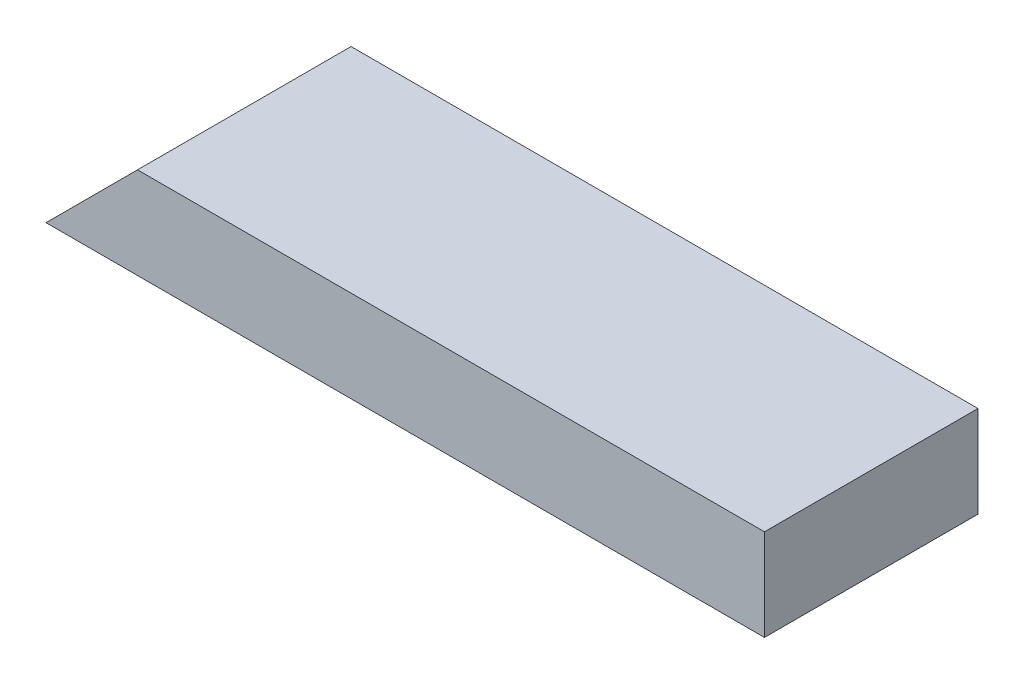
ISO-10303-21;
HEADER;
FILE_DESCRIPTION(('STEP AP214'),'2;1');
FILE_NAME('part.step','',(''),(''),'','','');
FILE_SCHEMA(('AUTOMOTIVE_DESIGN { 1 0 10303 214 1 1 1 1 }'));
ENDSEC;
DATA;
#1=APPLICATION_CONTEXT('core data for automotive mechanical design processes');
#2=APPLICATION_PROTOCOL_DEFINITION('international standard','automotive_design',2000,#1);
#3=PRODUCT_CONTEXT('',#1,'mechanical');
#4=PRODUCT('Part','Part','',(#3));
#5=PRODUCT_RELATED_PRODUCT_CATEGORY('part','',(#4));
#6=PRODUCT_DEFINITION_FORMATION('','',#4);
#7=PRODUCT_DEFINITION_CONTEXT('part definition',#1,'design');
#8=PRODUCT_DEFINITION('design','',#6,#7);
#9=PRODUCT_DEFINITION_SHAPE('','',#8);
#10=(LENGTH_UNIT() NAMED_UNIT(*) SI_UNIT(.MILLI.,.METRE.));
#11=(NAMED_UNIT(*) PLANE_ANGLE_UNIT() SI_UNIT($,.RADIAN.));
#12=(NAMED_UNIT(*) SI_UNIT($,.STERADIAN.) SOLID_ANGLE_UNIT());
#13=UNCERTAINTY_MEASURE_WITH_UNIT(LENGTH_MEASURE(1.E-05),#10,'distance_accuracy_value','');
#14=(GEOMETRIC_REPRESENTATION_CONTEXT(3) GLOBAL_UNCERTAINTY_ASSIGNED_CONTEXT((#13)) GLOBAL_UNIT_ASSIGNED_CONTEXT((#10,
#11,#12)) REPRESENTATION_CONTEXT('',''));
#15=CARTESIAN_POINT('',(0.,0.,0.));
#16=DIRECTION('',(0.,0.,1.));
#17=DIRECTION('',(1.,0.,0.));
#18=AXIS2_PLACEMENT_3D('',#15,#16,#17);
#19=CARTESIAN_POINT('',(0.,38.1,0.));
#20=DIRECTION('',(0.,0.,-1.));
#21=DIRECTION('',(-1.,0.,0.));
#22=AXIS2_PLACEMENT_3D('',#19,#20,#21);
#23=PLANE('',#22);
#24=DIRECTION('',(1.,0.,0.));
#25=VECTOR('',#24,1.);
#26=CARTESIAN_POINT('',(0.,38.1,0.));
#27=LINE('',#26,#25);
#28=CARTESIAN_POINT('',(38.1,38.1,0.));
#29=VERTEX_POINT('',#28);
#30=CARTESIAN_POINT('',(299.0977,38.1,0.));
#31=VERTEX_POINT('',#30);
#32=EDGE_CURVE('E92',#29,#31,#27,.T.);
#33=ORIENTED_EDGE('',*,*,#32,.F.);
#34=DIRECTION('',(0.707106781186547,0.707106781186547,0.));
#35=VECTOR('',#34,1.);
#36=CARTESIAN_POINT('',(0.,0.,0.));
#37=LINE('',#36,#35);
#38=CARTESIAN_POINT('',(0.,0.,0.));
#39=VERTEX_POINT('',#38);
#40=EDGE_CURVE('E86',#39,#29,#37,.T.);
#41=ORIENTED_EDGE('',*,*,#40,.F.);
#42=DIRECTION('',(1.,0.,0.));
#43=VECTOR('',#42,1.);
#44=CARTESIAN_POINT('',(0.,0.,0.));
#45=LINE('',#44,#43);
#46=CARTESIAN_POINT('',(299.0977,0.,0.));
#47=VERTEX_POINT('',#46);
#48=EDGE_CURVE('E96',#39,#47,#45,.T.);
#49=ORIENTED_EDGE('',*,*,#48,.T.);
#50=DIRECTION('',(0.,-1.,0.));
#51=VECTOR('',#50,1.);
#52=CARTESIAN_POINT('',(299.0977,38.1,0.));
#53=LINE('',#52,#51);
#54=EDGE_CURVE('E11',#31,#47,#53,.T.);
#55=ORIENTED_EDGE('',*,*,#54,.F.);
#56=EDGE_LOOP('',(#33,#41,#49,#55));
#57=FACE_BOUND('',#56,.T.);
#58=ADVANCED_FACE('F39',(#57),#23,.F.);
#59=CARTESIAN_POINT('',(299.0977,38.1,0.));
#60=DIRECTION('',(-1.,0.,0.));
#61=DIRECTION('',(0.,0.,1.));
#62=AXIS2_PLACEMENT_3D('',#59,#60,#61);
#63=PLANE('',#62);
#64=DIRECTION('',(0.,0.,-1.));
#65=VECTOR('',#64,1.);
#66=CARTESIAN_POINT('',(299.0977,0.,0.));
#67=LINE('',#66,#65);
#68=CARTESIAN_POINT('',(299.0977,0.,-88.9));
#69=VERTEX_POINT('',#68);
#70=EDGE_CURVE('E67',#47,#69,#67,.T.);
#71=ORIENTED_EDGE('',*,*,#70,.T.);
#72=DIRECTION('',(0.,-1.,0.));
#73=VECTOR('',#72,1.);
#74=CARTESIAN_POINT('',(299.0977,38.1,-88.9));
#75=LINE('',#74,#73);
#76=CARTESIAN_POINT('',(299.0977,38.1,-88.9));
#77=VERTEX_POINT('',#76);
#78=EDGE_CURVE('E47',#77,#69,#75,.T.);
#79=ORIENTED_EDGE('',*,*,#78,.F.);
#80=DIRECTION('',(0.,0.,-1.));
#81=VECTOR('',#80,1.);
#82=CARTESIAN_POINT('',(299.0977,38.1,0.));
#83=LINE('',#82,#81);
#84=EDGE_CURVE('E55',#31,#77,#83,.T.);
#85=ORIENTED_EDGE('',*,*,#84,.F.);
#86=ORIENTED_EDGE('',*,*,#54,.T.);
#87=EDGE_LOOP('',(#71,#79,#85,#86));
#88=FACE_BOUND('',#87,.T.);
#89=ADVANCED_FACE('F111',(#88),#63,.F.);
#90=CARTESIAN_POINT('',(0.,38.1,-88.9));
#91=DIRECTION('',(0.,0.,1.));
#92=DIRECTION('',(1.,0.,0.));
#93=AXIS2_PLACEMENT_3D('',#90,#91,#92);
#94=PLANE('',#93);
#95=DIRECTION('',(-1.,0.,0.));
#96=VECTOR('',#95,1.);
#97=CARTESIAN_POINT('',(0.,0.,-88.9));
#98=LINE('',#97,#96);
#99=CARTESIAN_POINT('',(0.,0.,-88.9));
#100=VERTEX_POINT('',#99);
#101=EDGE_CURVE('E89',#69,#100,#98,.T.);
#102=ORIENTED_EDGE('',*,*,#101,.T.);
#103=DIRECTION('',(0.707106781186547,0.707106781186547,0.));
#104=VECTOR('',#103,1.);
#105=CARTESIAN_POINT('',(0.,0.,-88.9));
#106=LINE('',#105,#104);
#107=CARTESIAN_POINT('',(38.1,38.1,-88.9));
#108=VERTEX_POINT('',#107);
#109=EDGE_CURVE('E74',#100,#108,#106,.T.);
#110=ORIENTED_EDGE('',*,*,#109,.T.);
#111=DIRECTION('',(-1.,0.,0.));
#112=VECTOR('',#111,1.);
#113=CARTESIAN_POINT('',(0.,38.1,-88.9));
#114=LINE('',#113,#112);
#115=EDGE_CURVE('E101',#77,#108,#114,.T.);
#116=ORIENTED_EDGE('',*,*,#115,.F.);
#117=ORIENTED_EDGE('',*,*,#78,.T.);
#118=EDGE_LOOP('',(#102,#110,#116,#117));
#119=FACE_BOUND('',#118,.T.);
#120=ADVANCED_FACE('F90',(#119),#94,.F.);
#121=CARTESIAN_POINT('',(0.,38.1,0.));
#122=DIRECTION('',(0.,-1.,0.));
#123=DIRECTION('',(0.,0.,-1.));
#124=AXIS2_PLACEMENT_3D('',#121,#122,#123);
#125=PLANE('',#124);
#126=ORIENTED_EDGE('',*,*,#115,.T.);
#127=DIRECTION('',(0.,0.,1.));
#128=VECTOR('',#127,1.);
#129=CARTESIAN_POINT('',(38.1,38.1,-88.9));
#130=LINE('',#129,#128);
#131=EDGE_CURVE('E83',#108,#29,#130,.T.);
#132=ORIENTED_EDGE('',*,*,#131,.T.);
#133=ORIENTED_EDGE('',*,*,#32,.T.);
#134=ORIENTED_EDGE('',*,*,#84,.T.);
#135=EDGE_LOOP('',(#126,#132,#133,#134));
#136=FACE_BOUND('',#135,.T.);
#137=ADVANCED_FACE('F109',(#136),#125,.F.);
#138=CARTESIAN_POINT('',(0.,0.,0.));
#139=DIRECTION('',(0.,-1.,0.));
#140=DIRECTION('',(0.,0.,-1.));
#141=AXIS2_PLACEMENT_3D('',#138,#139,#140);
#142=PLANE('',#141);
#143=DIRECTION('',(0.,0.,1.));
#144=VECTOR('',#143,1.);
#145=CARTESIAN_POINT('',(0.,0.,0.));
#146=LINE('',#145,#144);
#147=EDGE_CURVE('E80',#100,#39,#146,.T.);
#148=ORIENTED_EDGE('',*,*,#147,.F.);
#149=ORIENTED_EDGE('',*,*,#101,.F.);
#150=ORIENTED_EDGE('',*,*,#70,.F.);
#151=ORIENTED_EDGE('',*,*,#48,.F.);
#152=EDGE_LOOP('',(#148,#149,#150,#151));
#153=FACE_BOUND('',#152,.T.);
#154=ADVANCED_FACE('F95',(#153),#142,.T.);
#155=CARTESIAN_POINT('',(0.,0.,-88.9));
#156=DIRECTION('',(0.707106781186547,-0.707106781186547,0.));
#157=DIRECTION('',(0.707106781186548,0.707106781186548,0.));
#158=AXIS2_PLACEMENT_3D('',#155,#156,#157);
#159=PLANE('',#158);
#160=ORIENTED_EDGE('',*,*,#40,.T.);
#161=ORIENTED_EDGE('',*,*,#131,.F.);
#162=ORIENTED_EDGE('',*,*,#109,.F.);
#163=ORIENTED_EDGE('',*,*,#147,.T.);
#164=EDGE_LOOP('',(#160,#161,#162,#163));
#165=FACE_BOUND('',#164,.T.);
#166=ADVANCED_FACE('F77',(#165),#159,.F.);
#167=CLOSED_SHELL('',(#58,#89,#120,#137,#154,#166));
#168=MANIFOLD_SOLID_BREP('B2',#167);
#169=ADVANCED_BREP_SHAPE_REPRESENTATION('',(#18,#168),#14);
#170=SHAPE_DEFINITION_REPRESENTATION(#9,#169);
ENDSEC;
END-ISO-10303-21;
